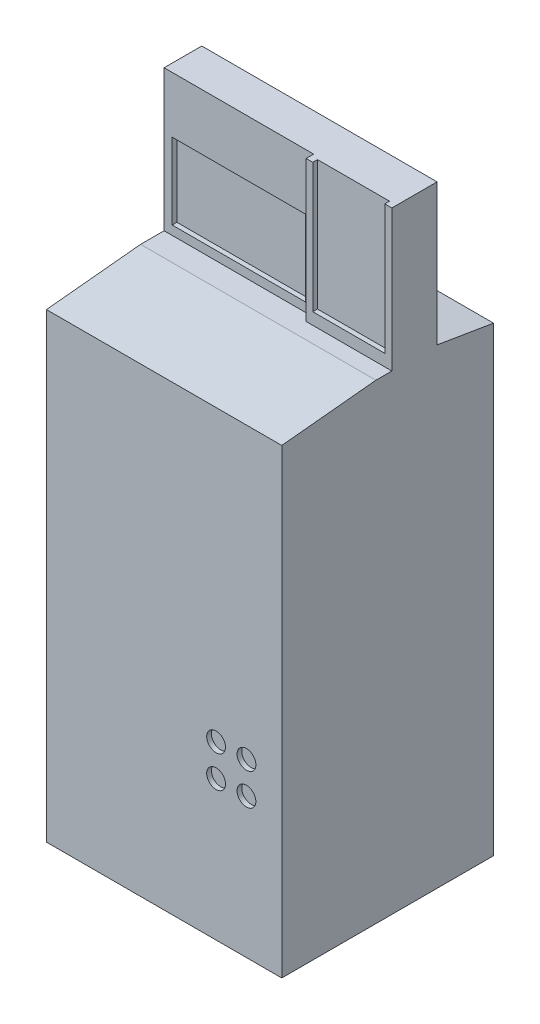
ISO-10303-21;
HEADER;
FILE_DESCRIPTION(('STEP AP214'),'2;1');
FILE_NAME('part.step','',(''),(''),'','','');
FILE_SCHEMA(('AUTOMOTIVE_DESIGN { 1 0 10303 214 1 1 1 1 }'));
ENDSEC;
DATA;
#1=APPLICATION_CONTEXT('core data for automotive mechanical design processes');
#2=APPLICATION_PROTOCOL_DEFINITION('international standard','automotive_design',2000,#1);
#3=PRODUCT_CONTEXT('',#1,'mechanical');
#4=PRODUCT('Part','Part','',(#3));
#5=PRODUCT_RELATED_PRODUCT_CATEGORY('part','',(#4));
#6=PRODUCT_DEFINITION_FORMATION('','',#4);
#7=PRODUCT_DEFINITION_CONTEXT('part definition',#1,'design');
#8=PRODUCT_DEFINITION('design','',#6,#7);
#9=PRODUCT_DEFINITION_SHAPE('','',#8);
#10=(LENGTH_UNIT() NAMED_UNIT(*) SI_UNIT(.MILLI.,.METRE.));
#11=(NAMED_UNIT(*) PLANE_ANGLE_UNIT() SI_UNIT($,.RADIAN.));
#12=(NAMED_UNIT(*) SI_UNIT($,.STERADIAN.) SOLID_ANGLE_UNIT());
#13=UNCERTAINTY_MEASURE_WITH_UNIT(LENGTH_MEASURE(1.E-05),#10,'distance_accuracy_value','');
#14=(GEOMETRIC_REPRESENTATION_CONTEXT(3) GLOBAL_UNCERTAINTY_ASSIGNED_CONTEXT((#13)) GLOBAL_UNIT_ASSIGNED_CONTEXT((#10,
#11,#12)) REPRESENTATION_CONTEXT('',''));
#15=CARTESIAN_POINT('',(0.,0.,0.));
#16=DIRECTION('',(0.,0.,1.));
#17=DIRECTION('',(1.,0.,0.));
#18=AXIS2_PLACEMENT_3D('',#15,#16,#17);
#19=CARTESIAN_POINT('',(0.,800.,0.));
#20=DIRECTION('',(0.,-1.,0.));
#21=DIRECTION('',(0.,0.,-1.));
#22=AXIS2_PLACEMENT_3D('',#19,#20,#21);
#23=PLANE('',#22);
#24=DIRECTION('',(1.,0.,0.));
#25=VECTOR('',#24,1.);
#26=CARTESIAN_POINT('',(0.,800.,-24.999984779868));
#27=LINE('',#26,#25);
#28=CARTESIAN_POINT('',(-250.,800.,-24.999984779868));
#29=VERTEX_POINT('',#28);
#30=CARTESIAN_POINT('',(67.8160506672203,800.,-24.999984779868));
#31=VERTEX_POINT('',#30);
#32=EDGE_CURVE('E309',#29,#31,#27,.T.);
#33=ORIENTED_EDGE('',*,*,#32,.F.);
#34=DIRECTION('',(0.,0.,1.));
#35=VECTOR('',#34,1.);
#36=CARTESIAN_POINT('',(-250.,800.,225.));
#37=LINE('',#36,#35);
#38=CARTESIAN_POINT('',(-250.,800.,24.999999999993));
#39=VERTEX_POINT('',#38);
#40=EDGE_CURVE('E359',#29,#39,#37,.T.);
#41=ORIENTED_EDGE('',*,*,#40,.T.);
#42=DIRECTION('',(1.,0.,0.));
#43=VECTOR('',#42,1.);
#44=CARTESIAN_POINT('',(250.,800.,24.999999999993));
#45=LINE('',#44,#43);
#46=CARTESIAN_POINT('',(250.,800.,24.999999999993));
#47=VERTEX_POINT('',#46);
#48=EDGE_CURVE('E377',#39,#47,#45,.T.);
#49=ORIENTED_EDGE('',*,*,#48,.T.);
#50=DIRECTION('',(0.,0.,-1.));
#51=VECTOR('',#50,1.);
#52=CARTESIAN_POINT('',(250.,800.,225.));
#53=LINE('',#52,#51);
#54=CARTESIAN_POINT('',(250.,800.,-8.90804055374794));
#55=VERTEX_POINT('',#54);
#56=EDGE_CURVE('E357',#47,#55,#53,.T.);
#57=ORIENTED_EDGE('',*,*,#56,.T.);
#58=DIRECTION('',(1.,0.,0.));
#59=VECTOR('',#58,1.);
#60=CARTESIAN_POINT('',(0.,800.,-8.90804055374795));
#61=LINE('',#60,#59);
#62=CARTESIAN_POINT('',(67.8160506672203,800.,-8.90804055374795));
#63=VERTEX_POINT('',#62);
#64=EDGE_CURVE('E320',#63,#55,#61,.T.);
#65=ORIENTED_EDGE('',*,*,#64,.F.);
#66=DIRECTION('',(0.,0.,1.));
#67=VECTOR('',#66,1.);
#68=CARTESIAN_POINT('',(67.8160506672203,800.,0.));
#69=LINE('',#68,#67);
#70=EDGE_CURVE('E335',#31,#63,#69,.T.);
#71=ORIENTED_EDGE('',*,*,#70,.F.);
#72=EDGE_LOOP('',(#33,#41,#49,#57,#65,#71));
#73=FACE_BOUND('',#72,.T.);
#74=ADVANCED_FACE('F41',(#73),#23,.F.);
#75=CARTESIAN_POINT('',(250.,-200.,225.));
#76=DIRECTION('',(1.,0.,0.));
#77=DIRECTION('',(0.,0.,-1.));
#78=AXIS2_PLACEMENT_3D('',#75,#76,#77);
#79=PLANE('',#78);
#80=DIRECTION('',(0.,1.,0.));
#81=VECTOR('',#80,1.);
#82=CARTESIAN_POINT('',(250.,-200.,-225.));
#83=LINE('',#82,#81);
#84=CARTESIAN_POINT('',(250.,-200.,-225.));
#85=VERTEX_POINT('',#84);
#86=CARTESIAN_POINT('',(250.,780.,-225.));
#87=VERTEX_POINT('',#86);
#88=EDGE_CURVE('E373',#85,#87,#83,.T.);
#89=ORIENTED_EDGE('',*,*,#88,.T.);
#90=DIRECTION('',(0.,0.164398987305354,0.986393923832144));
#91=VECTOR('',#90,1.);
#92=CARTESIAN_POINT('',(250.,826.486486486486,53.9189189189228));
#93=LINE('',#92,#91);
#94=CARTESIAN_POINT('',(250.,800.,-104.999999999997));
#95=VERTEX_POINT('',#94);
#96=EDGE_CURVE('E11',#87,#95,#93,.T.);
#97=ORIENTED_EDGE('',*,*,#96,.T.);
#98=DIRECTION('',(0.,-1.,0.));
#99=VECTOR('',#98,1.);
#100=CARTESIAN_POINT('',(250.,1100.,-104.999999999997));
#101=LINE('',#100,#99);
#102=CARTESIAN_POINT('',(250.,1100.,-104.999999999997));
#103=VERTEX_POINT('',#102);
#104=EDGE_CURVE('E345',#103,#95,#101,.T.);
#105=ORIENTED_EDGE('',*,*,#104,.F.);
#106=DIRECTION('',(0.,0.,-1.));
#107=VECTOR('',#106,1.);
#108=CARTESIAN_POINT('',(250.,1100.,0.));
#109=LINE('',#108,#107);
#110=CARTESIAN_POINT('',(250.,1100.,-8.90804055374795));
#111=VERTEX_POINT('',#110);
#112=EDGE_CURVE('E326',#111,#103,#109,.T.);
#113=ORIENTED_EDGE('',*,*,#112,.F.);
#114=DIRECTION('',(0.,-1.,0.));
#115=VECTOR('',#114,1.);
#116=CARTESIAN_POINT('',(250.,1100.,-8.90804055374795));
#117=LINE('',#116,#115);
#118=EDGE_CURVE('E348',#111,#55,#117,.T.);
#119=ORIENTED_EDGE('',*,*,#118,.T.);
#120=ORIENTED_EDGE('',*,*,#56,.F.);
#121=DIRECTION('',(0.,-0.0995037190209955,0.995037190209989));
#122=VECTOR('',#121,1.);
#123=CARTESIAN_POINT('',(250.,770.297029702971,322.029702970294));
#124=LINE('',#123,#122);
#125=CARTESIAN_POINT('',(250.,780.,225.));
#126=VERTEX_POINT('',#125);
#127=EDGE_CURVE('E388',#47,#126,#124,.T.);
#128=ORIENTED_EDGE('',*,*,#127,.T.);
#129=DIRECTION('',(0.,1.,0.));
#130=VECTOR('',#129,1.);
#131=CARTESIAN_POINT('',(250.,-200.,225.));
#132=LINE('',#131,#130);
#133=CARTESIAN_POINT('',(250.,-200.,225.));
#134=VERTEX_POINT('',#133);
#135=EDGE_CURVE('E374',#134,#126,#132,.T.);
#136=ORIENTED_EDGE('',*,*,#135,.F.);
#137=DIRECTION('',(0.,0.,-1.));
#138=VECTOR('',#137,1.);
#139=CARTESIAN_POINT('',(250.,-200.,225.));
#140=LINE('',#139,#138);
#141=EDGE_CURVE('E361',#134,#85,#140,.T.);
#142=ORIENTED_EDGE('',*,*,#141,.T.);
#143=EDGE_LOOP('',(#89,#97,#105,#113,#119,#120,#128,#136,#142));
#144=FACE_BOUND('',#143,.T.);
#145=ADVANCED_FACE('F406',(#144),#79,.T.);
#146=CARTESIAN_POINT('',(-250.,-200.,225.));
#147=DIRECTION('',(0.,0.,1.));
#148=DIRECTION('',(1.,0.,0.));
#149=AXIS2_PLACEMENT_3D('',#146,#147,#148);
#150=PLANE('',#149);
#151=CARTESIAN_POINT('',(174.96796499829,164.751161955834,225.));
#152=DIRECTION('',(0.,0.,1.));
#153=DIRECTION('',(1.,0.,0.));
#154=AXIS2_PLACEMENT_3D('',#151,#152,#153);
#155=CIRCLE('',#154,20.);
#156=CARTESIAN_POINT('',(194.96796499829,164.751161955834,225.));
#157=VERTEX_POINT('',#156);
#158=EDGE_CURVE('E272',#157,#157,#155,.T.);
#159=ORIENTED_EDGE('',*,*,#158,.F.);
#160=EDGE_LOOP('',(#159));
#161=FACE_BOUND('',#160,.T.);
#162=CARTESIAN_POINT('',(110.472474250745,97.0628251316776,225.));
#163=DIRECTION('',(0.,0.,1.));
#164=DIRECTION('',(1.,0.,0.));
#165=AXIS2_PLACEMENT_3D('',#162,#163,#164);
#166=CIRCLE('',#165,20.);
#167=CARTESIAN_POINT('',(130.472474250745,97.0628251316776,225.));
#168=VERTEX_POINT('',#167);
#169=EDGE_CURVE('E265',#168,#168,#166,.T.);
#170=ORIENTED_EDGE('',*,*,#169,.F.);
#171=EDGE_LOOP('',(#170));
#172=FACE_BOUND('',#171,.T.);
#173=CARTESIAN_POINT('',(174.96796499829,97.0628251316776,225.));
#174=DIRECTION('',(0.,0.,1.));
#175=DIRECTION('',(1.,0.,0.));
#176=AXIS2_PLACEMENT_3D('',#173,#174,#175);
#177=CIRCLE('',#176,20.);
#178=CARTESIAN_POINT('',(194.96796499829,97.0628251316776,225.));
#179=VERTEX_POINT('',#178);
#180=EDGE_CURVE('E255',#179,#179,#177,.T.);
#181=ORIENTED_EDGE('',*,*,#180,.F.);
#182=EDGE_LOOP('',(#181));
#183=FACE_BOUND('',#182,.T.);
#184=CARTESIAN_POINT('',(110.472474250745,164.751161955834,225.));
#185=DIRECTION('',(0.,0.,1.));
#186=DIRECTION('',(1.,0.,0.));
#187=AXIS2_PLACEMENT_3D('',#184,#185,#186);
#188=CIRCLE('',#187,20.);
#189=CARTESIAN_POINT('',(130.472474250745,164.751161955834,225.));
#190=VERTEX_POINT('',#189);
#191=EDGE_CURVE('E271',#190,#190,#188,.T.);
#192=ORIENTED_EDGE('',*,*,#191,.F.);
#193=EDGE_LOOP('',(#192));
#194=FACE_BOUND('',#193,.T.);
#195=ORIENTED_EDGE('',*,*,#135,.T.);
#196=DIRECTION('',(-1.,0.,0.));
#197=VECTOR('',#196,1.);
#198=CARTESIAN_POINT('',(-250.,780.,225.));
#199=LINE('',#198,#197);
#200=CARTESIAN_POINT('',(-250.,780.,225.));
#201=VERTEX_POINT('',#200);
#202=EDGE_CURVE('E390',#126,#201,#199,.T.);
#203=ORIENTED_EDGE('',*,*,#202,.T.);
#204=DIRECTION('',(0.,1.,0.));
#205=VECTOR('',#204,1.);
#206=CARTESIAN_POINT('',(-250.,-200.,225.));
#207=LINE('',#206,#205);
#208=CARTESIAN_POINT('',(-250.,-200.,225.));
#209=VERTEX_POINT('',#208);
#210=EDGE_CURVE('E378',#209,#201,#207,.T.);
#211=ORIENTED_EDGE('',*,*,#210,.F.);
#212=DIRECTION('',(1.,0.,0.));
#213=VECTOR('',#212,1.);
#214=CARTESIAN_POINT('',(-250.,-200.,225.));
#215=LINE('',#214,#213);
#216=EDGE_CURVE('E370',#209,#134,#215,.T.);
#217=ORIENTED_EDGE('',*,*,#216,.T.);
#218=EDGE_LOOP('',(#195,#203,#211,#217));
#219=FACE_BOUND('',#218,.T.);
#220=ADVANCED_FACE('F446',(#161,#172,#183,#194,#219),#150,.T.);
#221=CARTESIAN_POINT('',(-250.,-200.,225.));
#222=DIRECTION('',(-1.,0.,0.));
#223=DIRECTION('',(0.,0.,1.));
#224=AXIS2_PLACEMENT_3D('',#221,#222,#223);
#225=PLANE('',#224);
#226=ORIENTED_EDGE('',*,*,#40,.F.);
#227=DIRECTION('',(0.,-1.,0.));
#228=VECTOR('',#227,1.);
#229=CARTESIAN_POINT('',(-250.,1100.,-24.999984779868));
#230=LINE('',#229,#228);
#231=CARTESIAN_POINT('',(-250.,1100.,-24.999984779868));
#232=VERTEX_POINT('',#231);
#233=EDGE_CURVE('E332',#232,#29,#230,.T.);
#234=ORIENTED_EDGE('',*,*,#233,.F.);
#235=DIRECTION('',(0.,0.,1.));
#236=VECTOR('',#235,1.);
#237=CARTESIAN_POINT('',(-250.,1100.,0.));
#238=LINE('',#237,#236);
#239=CARTESIAN_POINT('',(-250.,1100.,-104.999999999997));
#240=VERTEX_POINT('',#239);
#241=EDGE_CURVE('E330',#240,#232,#238,.T.);
#242=ORIENTED_EDGE('',*,*,#241,.F.);
#243=DIRECTION('',(0.,-1.,0.));
#244=VECTOR('',#243,1.);
#245=CARTESIAN_POINT('',(-250.,1100.,-104.999999999997));
#246=LINE('',#245,#244);
#247=CARTESIAN_POINT('',(-250.,800.,-104.999999999997));
#248=VERTEX_POINT('',#247);
#249=EDGE_CURVE('E342',#240,#248,#246,.T.);
#250=ORIENTED_EDGE('',*,*,#249,.T.);
#251=DIRECTION('',(0.,-0.164398987305354,-0.986393923832144));
#252=VECTOR('',#251,1.);
#253=CARTESIAN_POINT('',(-250.,826.486486486486,53.9189189189228));
#254=LINE('',#253,#252);
#255=CARTESIAN_POINT('',(-250.,780.,-225.));
#256=VERTEX_POINT('',#255);
#257=EDGE_CURVE('E398',#248,#256,#254,.T.);
#258=ORIENTED_EDGE('',*,*,#257,.T.);
#259=DIRECTION('',(0.,1.,0.));
#260=VECTOR('',#259,1.);
#261=CARTESIAN_POINT('',(-250.,-200.,-225.));
#262=LINE('',#261,#260);
#263=CARTESIAN_POINT('',(-250.,-200.,-225.));
#264=VERTEX_POINT('',#263);
#265=EDGE_CURVE('E381',#264,#256,#262,.T.);
#266=ORIENTED_EDGE('',*,*,#265,.F.);
#267=DIRECTION('',(0.,0.,1.));
#268=VECTOR('',#267,1.);
#269=CARTESIAN_POINT('',(-250.,-200.,225.));
#270=LINE('',#269,#268);
#271=EDGE_CURVE('E367',#264,#209,#270,.T.);
#272=ORIENTED_EDGE('',*,*,#271,.T.);
#273=ORIENTED_EDGE('',*,*,#210,.T.);
#274=DIRECTION('',(0.,0.0995037190209955,-0.995037190209989));
#275=VECTOR('',#274,1.);
#276=CARTESIAN_POINT('',(-250.,770.297029702971,322.029702970294));
#277=LINE('',#276,#275);
#278=EDGE_CURVE('E392',#201,#39,#277,.T.);
#279=ORIENTED_EDGE('',*,*,#278,.T.);
#280=EDGE_LOOP('',(#226,#234,#242,#250,#258,#266,#272,#273,#279));
#281=FACE_BOUND('',#280,.T.);
#282=ADVANCED_FACE('F438',(#281),#225,.T.);
#283=CARTESIAN_POINT('',(-250.,-200.,-225.));
#284=DIRECTION('',(0.,0.,-1.));
#285=DIRECTION('',(-1.,0.,0.));
#286=AXIS2_PLACEMENT_3D('',#283,#284,#285);
#287=PLANE('',#286);
#288=DIRECTION('',(0.,-1.,0.));
#289=VECTOR('',#288,1.);
#290=CARTESIAN_POINT('',(201.098373674837,108.605665582961,-225.));
#291=LINE('',#290,#289);
#292=CARTESIAN_POINT('',(201.098373674837,108.605665582961,-225.));
#293=VERTEX_POINT('',#292);
#294=CARTESIAN_POINT('',(201.098373674837,-164.043042544086,-225.));
#295=VERTEX_POINT('',#294);
#296=EDGE_CURVE('E57',#293,#295,#291,.T.);
#297=ORIENTED_EDGE('',*,*,#296,.F.);
#298=DIRECTION('',(1.,0.,0.));
#299=VECTOR('',#298,1.);
#300=CARTESIAN_POINT('',(201.098373674837,108.605665582961,-225.));
#301=LINE('',#300,#299);
#302=CARTESIAN_POINT('',(-201.201468386829,108.605665582961,-225.));
#303=VERTEX_POINT('',#302);
#304=EDGE_CURVE('E218',#303,#293,#301,.T.);
#305=ORIENTED_EDGE('',*,*,#304,.F.);
#306=DIRECTION('',(0.,1.,0.));
#307=VECTOR('',#306,1.);
#308=CARTESIAN_POINT('',(-201.201468386829,108.605665582961,-225.));
#309=LINE('',#308,#307);
#310=CARTESIAN_POINT('',(-201.201468386829,-164.043042544086,-225.));
#311=VERTEX_POINT('',#310);
#312=EDGE_CURVE('E221',#311,#303,#309,.T.);
#313=ORIENTED_EDGE('',*,*,#312,.F.);
#314=DIRECTION('',(-1.,0.,0.));
#315=VECTOR('',#314,1.);
#316=CARTESIAN_POINT('',(201.098373674837,-164.043042544086,-225.));
#317=LINE('',#316,#315);
#318=EDGE_CURVE('E227',#295,#311,#317,.T.);
#319=ORIENTED_EDGE('',*,*,#318,.F.);
#320=EDGE_LOOP('',(#297,#305,#313,#319));
#321=FACE_BOUND('',#320,.T.);
#322=ORIENTED_EDGE('',*,*,#265,.T.);
#323=DIRECTION('',(1.,0.,0.));
#324=VECTOR('',#323,1.);
#325=CARTESIAN_POINT('',(250.,780.,-225.));
#326=LINE('',#325,#324);
#327=EDGE_CURVE('E50',#256,#87,#326,.T.);
#328=ORIENTED_EDGE('',*,*,#327,.T.);
#329=ORIENTED_EDGE('',*,*,#88,.F.);
#330=DIRECTION('',(-1.,0.,0.));
#331=VECTOR('',#330,1.);
#332=CARTESIAN_POINT('',(-250.,-200.,-225.));
#333=LINE('',#332,#331);
#334=EDGE_CURVE('E364',#85,#264,#333,.T.);
#335=ORIENTED_EDGE('',*,*,#334,.T.);
#336=EDGE_LOOP('',(#322,#328,#329,#335));
#337=FACE_BOUND('',#336,.T.);
#338=ADVANCED_FACE('F401',(#321,#337),#287,.T.);
#339=CARTESIAN_POINT('',(0.,-200.,0.));
#340=DIRECTION('',(0.,-1.,0.));
#341=DIRECTION('',(0.,0.,-1.));
#342=AXIS2_PLACEMENT_3D('',#339,#340,#341);
#343=PLANE('',#342);
#344=ORIENTED_EDGE('',*,*,#141,.F.);
#345=ORIENTED_EDGE('',*,*,#216,.F.);
#346=ORIENTED_EDGE('',*,*,#271,.F.);
#347=ORIENTED_EDGE('',*,*,#334,.F.);
#348=EDGE_LOOP('',(#344,#345,#346,#347));
#349=FACE_BOUND('',#348,.T.);
#350=ADVANCED_FACE('F450',(#349),#343,.T.);
#351=CARTESIAN_POINT('',(0.,800.,24.999999999993));
#352=DIRECTION('',(0.,0.995037190209989,0.0995037190209955));
#353=DIRECTION('',(-1.,0.,0.));
#354=AXIS2_PLACEMENT_3D('',#351,#352,#353);
#355=PLANE('',#354);
#356=ORIENTED_EDGE('',*,*,#278,.F.);
#357=ORIENTED_EDGE('',*,*,#202,.F.);
#358=ORIENTED_EDGE('',*,*,#127,.F.);
#359=ORIENTED_EDGE('',*,*,#48,.F.);
#360=EDGE_LOOP('',(#356,#357,#358,#359));
#361=FACE_BOUND('',#360,.T.);
#362=ADVANCED_FACE('F444',(#361),#355,.T.);
#363=CARTESIAN_POINT('',(0.,800.,-104.999999999997));
#364=DIRECTION('',(0.,0.986393923832144,-0.164398987305354));
#365=DIRECTION('',(1.,0.,0.));
#366=AXIS2_PLACEMENT_3D('',#363,#364,#365);
#367=PLANE('',#366);
#368=ORIENTED_EDGE('',*,*,#96,.F.);
#369=ORIENTED_EDGE('',*,*,#327,.F.);
#370=ORIENTED_EDGE('',*,*,#257,.F.);
#371=DIRECTION('',(-1.,0.,0.));
#372=VECTOR('',#371,1.);
#373=CARTESIAN_POINT('',(-250.,800.,-104.999999999997));
#374=LINE('',#373,#372);
#375=EDGE_CURVE('E395',#95,#248,#374,.T.);
#376=ORIENTED_EDGE('',*,*,#375,.F.);
#377=EDGE_LOOP('',(#368,#369,#370,#376));
#378=FACE_BOUND('',#377,.T.);
#379=ADVANCED_FACE('F44',(#378),#367,.T.);
#380=CARTESIAN_POINT('',(0.,1100.,-24.999984779868));
#381=DIRECTION('',(0.,0.,-1.));
#382=DIRECTION('',(-1.,0.,0.));
#383=AXIS2_PLACEMENT_3D('',#380,#381,#382);
#384=PLANE('',#383);
#385=DIRECTION('',(0.,1.,0.));
#386=VECTOR('',#385,1.);
#387=CARTESIAN_POINT('',(50.6339517604435,0.,-24.999984779868));
#388=LINE('',#387,#386);
#389=CARTESIAN_POINT('',(50.6339517604435,819.185653331347,-24.999984779868));
#390=VERTEX_POINT('',#389);
#391=CARTESIAN_POINT('',(50.6339517604435,980.814346668653,-24.999984779868));
#392=VERTEX_POINT('',#391);
#393=EDGE_CURVE('E299',#390,#392,#388,.T.);
#394=ORIENTED_EDGE('',*,*,#393,.F.);
#395=DIRECTION('',(1.,0.,0.));
#396=VECTOR('',#395,1.);
#397=CARTESIAN_POINT('',(0.,819.185653331347,-24.999984779868));
#398=LINE('',#397,#396);
#399=CARTESIAN_POINT('',(-232.817901093223,819.185653331347,-24.999984779868));
#400=VERTEX_POINT('',#399);
#401=EDGE_CURVE('E283',#400,#390,#398,.T.);
#402=ORIENTED_EDGE('',*,*,#401,.F.);
#403=DIRECTION('',(0.,1.,0.));
#404=VECTOR('',#403,1.);
#405=CARTESIAN_POINT('',(-232.817901093223,0.,-24.999984779868));
#406=LINE('',#405,#404);
#407=CARTESIAN_POINT('',(-232.817901093223,980.814346668653,-24.999984779868));
#408=VERTEX_POINT('',#407);
#409=EDGE_CURVE('E290',#400,#408,#406,.T.);
#410=ORIENTED_EDGE('',*,*,#409,.T.);
#411=DIRECTION('',(1.,0.,0.));
#412=VECTOR('',#411,1.);
#413=CARTESIAN_POINT('',(0.,980.814346668653,-24.999984779868));
#414=LINE('',#413,#412);
#415=EDGE_CURVE('E302',#408,#392,#414,.T.);
#416=ORIENTED_EDGE('',*,*,#415,.T.);
#417=EDGE_LOOP('',(#394,#402,#410,#416));
#418=FACE_BOUND('',#417,.T.);
#419=ORIENTED_EDGE('',*,*,#32,.T.);
#420=DIRECTION('',(0.,-1.,0.));
#421=VECTOR('',#420,1.);
#422=CARTESIAN_POINT('',(67.8160506672203,1100.,-24.999984779868));
#423=LINE('',#422,#421);
#424=CARTESIAN_POINT('',(67.8160506672203,1100.,-24.999984779868));
#425=VERTEX_POINT('',#424);
#426=EDGE_CURVE('E354',#425,#31,#423,.T.);
#427=ORIENTED_EDGE('',*,*,#426,.F.);
#428=DIRECTION('',(1.,0.,0.));
#429=VECTOR('',#428,1.);
#430=CARTESIAN_POINT('',(0.,1100.,-24.999984779868));
#431=LINE('',#430,#429);
#432=EDGE_CURVE('E316',#232,#425,#431,.T.);
#433=ORIENTED_EDGE('',*,*,#432,.F.);
#434=ORIENTED_EDGE('',*,*,#233,.T.);
#435=EDGE_LOOP('',(#419,#427,#433,#434));
#436=FACE_BOUND('',#435,.T.);
#437=ADVANCED_FACE('F434',(#418,#436),#384,.F.);
#438=CARTESIAN_POINT('',(67.8160506672203,1100.,0.));
#439=DIRECTION('',(1.,0.,0.));
#440=DIRECTION('',(0.,0.,-1.));
#441=AXIS2_PLACEMENT_3D('',#438,#439,#440);
#442=PLANE('',#441);
#443=ORIENTED_EDGE('',*,*,#70,.T.);
#444=DIRECTION('',(0.,-1.,0.));
#445=VECTOR('',#444,1.);
#446=CARTESIAN_POINT('',(67.8160506672203,1100.,-8.90804055374795));
#447=LINE('',#446,#445);
#448=CARTESIAN_POINT('',(67.8160506672203,1100.,-8.90804055374795));
#449=VERTEX_POINT('',#448);
#450=EDGE_CURVE('E351',#449,#63,#447,.T.);
#451=ORIENTED_EDGE('',*,*,#450,.F.);
#452=DIRECTION('',(0.,0.,1.));
#453=VECTOR('',#452,1.);
#454=CARTESIAN_POINT('',(67.8160506672203,1100.,0.));
#455=LINE('',#454,#453);
#456=EDGE_CURVE('E319',#425,#449,#455,.T.);
#457=ORIENTED_EDGE('',*,*,#456,.F.);
#458=ORIENTED_EDGE('',*,*,#426,.T.);
#459=EDGE_LOOP('',(#443,#451,#457,#458));
#460=FACE_BOUND('',#459,.T.);
#461=ADVANCED_FACE('F430',(#460),#442,.F.);
#462=CARTESIAN_POINT('',(0.,1100.,-8.90804055374795));
#463=DIRECTION('',(0.,0.,-1.));
#464=DIRECTION('',(-1.,0.,0.));
#465=AXIS2_PLACEMENT_3D('',#462,#463,#464);
#466=PLANE('',#465);
#467=DIRECTION('',(1.,0.,0.));
#468=VECTOR('',#467,1.);
#469=CARTESIAN_POINT('',(81.9672277723067,825.045113674106,-8.90804055374795));
#470=LINE('',#469,#468);
#471=CARTESIAN_POINT('',(81.9672277723067,825.045113674106,-8.90804055374795));
#472=VERTEX_POINT('',#471);
#473=CARTESIAN_POINT('',(234.964906360065,825.045113674106,-8.90804055374795));
#474=VERTEX_POINT('',#473);
#475=EDGE_CURVE('E249',#472,#474,#470,.T.);
#476=ORIENTED_EDGE('',*,*,#475,.F.);
#477=DIRECTION('',(0.,-1.,0.));
#478=VECTOR('',#477,1.);
#479=CARTESIAN_POINT('',(81.9672277723067,1100.,-8.90804055374795));
#480=LINE('',#479,#478);
#481=CARTESIAN_POINT('',(81.9672277723067,1100.,-8.90804055374795));
#482=VERTEX_POINT('',#481);
#483=EDGE_CURVE('E233',#482,#472,#480,.T.);
#484=ORIENTED_EDGE('',*,*,#483,.F.);
#485=DIRECTION('',(1.,0.,0.));
#486=VECTOR('',#485,1.);
#487=CARTESIAN_POINT('',(0.,1100.,-8.90804055374795));
#488=LINE('',#487,#486);
#489=EDGE_CURVE('E323',#449,#482,#488,.T.);
#490=ORIENTED_EDGE('',*,*,#489,.F.);
#491=ORIENTED_EDGE('',*,*,#450,.T.);
#492=ORIENTED_EDGE('',*,*,#64,.T.);
#493=ORIENTED_EDGE('',*,*,#118,.F.);
#494=CARTESIAN_POINT('',(234.964906360065,1100.,-8.90804055374795));
#495=VERTEX_POINT('',#494);
#496=EDGE_CURVE('E322',#495,#111,#488,.T.);
#497=ORIENTED_EDGE('',*,*,#496,.F.);
#498=DIRECTION('',(0.,1.,0.));
#499=VECTOR('',#498,1.);
#500=CARTESIAN_POINT('',(234.964906360065,1100.,-8.90804055374795));
#501=LINE('',#500,#499);
#502=EDGE_CURVE('E241',#474,#495,#501,.T.);
#503=ORIENTED_EDGE('',*,*,#502,.F.);
#504=EDGE_LOOP('',(#476,#484,#490,#491,#492,#493,#497,#503));
#505=FACE_BOUND('',#504,.T.);
#506=ADVANCED_FACE('F425',(#505),#466,.F.);
#507=CARTESIAN_POINT('',(0.,1100.,-104.999999999997));
#508=DIRECTION('',(0.,0.,1.));
#509=DIRECTION('',(1.,0.,0.));
#510=AXIS2_PLACEMENT_3D('',#507,#508,#509);
#511=PLANE('',#510);
#512=ORIENTED_EDGE('',*,*,#375,.T.);
#513=ORIENTED_EDGE('',*,*,#249,.F.);
#514=DIRECTION('',(-1.,0.,0.));
#515=VECTOR('',#514,1.);
#516=CARTESIAN_POINT('',(0.,1100.,-104.999999999997));
#517=LINE('',#516,#515);
#518=EDGE_CURVE('E328',#103,#240,#517,.T.);
#519=ORIENTED_EDGE('',*,*,#518,.F.);
#520=ORIENTED_EDGE('',*,*,#104,.T.);
#521=EDGE_LOOP('',(#512,#513,#519,#520));
#522=FACE_BOUND('',#521,.T.);
#523=ADVANCED_FACE('F413',(#522),#511,.F.);
#524=CARTESIAN_POINT('',(0.,1100.,0.));
#525=DIRECTION('',(0.,1.,0.));
#526=DIRECTION('',(0.,0.,1.));
#527=AXIS2_PLACEMENT_3D('',#524,#525,#526);
#528=PLANE('',#527);
#529=DIRECTION('',(0.,0.,1.));
#530=VECTOR('',#529,1.);
#531=CARTESIAN_POINT('',(81.9672277723067,1100.,-18.908040553748));
#532=LINE('',#531,#530);
#533=CARTESIAN_POINT('',(81.9672277723067,1100.,-18.908040553748));
#534=VERTEX_POINT('',#533);
#535=EDGE_CURVE('E253',#534,#482,#532,.T.);
#536=ORIENTED_EDGE('',*,*,#535,.F.);
#537=DIRECTION('',(-1.,0.,0.));
#538=VECTOR('',#537,1.);
#539=CARTESIAN_POINT('',(81.9672277723067,1100.,-18.908040553748));
#540=LINE('',#539,#538);
#541=CARTESIAN_POINT('',(234.964906360065,1100.,-18.908040553748));
#542=VERTEX_POINT('',#541);
#543=EDGE_CURVE('E244',#542,#534,#540,.T.);
#544=ORIENTED_EDGE('',*,*,#543,.F.);
#545=DIRECTION('',(0.,0.,1.));
#546=VECTOR('',#545,1.);
#547=CARTESIAN_POINT('',(234.964906360065,1100.,-18.908040553748));
#548=LINE('',#547,#546);
#549=EDGE_CURVE('E256',#542,#495,#548,.T.);
#550=ORIENTED_EDGE('',*,*,#549,.T.);
#551=ORIENTED_EDGE('',*,*,#496,.T.);
#552=ORIENTED_EDGE('',*,*,#112,.T.);
#553=ORIENTED_EDGE('',*,*,#518,.T.);
#554=ORIENTED_EDGE('',*,*,#241,.T.);
#555=ORIENTED_EDGE('',*,*,#432,.T.);
#556=ORIENTED_EDGE('',*,*,#456,.T.);
#557=ORIENTED_EDGE('',*,*,#489,.T.);
#558=EDGE_LOOP('',(#536,#544,#550,#551,#552,#553,#554,#555,#556,#557));
#559=FACE_BOUND('',#558,.T.);
#560=ADVANCED_FACE('F419',(#559),#528,.T.);
#561=CARTESIAN_POINT('',(0.,819.185653331347,-34.999984779868));
#562=DIRECTION('',(0.,-1.,0.));
#563=DIRECTION('',(0.,0.,-1.));
#564=AXIS2_PLACEMENT_3D('',#561,#562,#563);
#565=PLANE('',#564);
#566=ORIENTED_EDGE('',*,*,#401,.T.);
#567=DIRECTION('',(0.,0.,1.));
#568=VECTOR('',#567,1.);
#569=CARTESIAN_POINT('',(50.6339517604435,819.185653331347,-34.999984779868));
#570=LINE('',#569,#568);
#571=CARTESIAN_POINT('',(50.6339517604435,819.185653331347,-34.999984779868));
#572=VERTEX_POINT('',#571);
#573=EDGE_CURVE('E297',#572,#390,#570,.T.);
#574=ORIENTED_EDGE('',*,*,#573,.F.);
#575=DIRECTION('',(1.,0.,0.));
#576=VECTOR('',#575,1.);
#577=CARTESIAN_POINT('',(0.,819.185653331347,-34.999984779868));
#578=LINE('',#577,#576);
#579=CARTESIAN_POINT('',(-232.817901093223,819.185653331347,-34.999984779868));
#580=VERTEX_POINT('',#579);
#581=EDGE_CURVE('E286',#580,#572,#578,.T.);
#582=ORIENTED_EDGE('',*,*,#581,.F.);
#583=DIRECTION('',(0.,0.,1.));
#584=VECTOR('',#583,1.);
#585=CARTESIAN_POINT('',(-232.817901093223,819.185653331347,-34.999984779868));
#586=LINE('',#585,#584);
#587=EDGE_CURVE('E307',#580,#400,#586,.T.);
#588=ORIENTED_EDGE('',*,*,#587,.T.);
#589=EDGE_LOOP('',(#566,#574,#582,#588));
#590=FACE_BOUND('',#589,.T.);
#591=ADVANCED_FACE('F510',(#590),#565,.F.);
#592=CARTESIAN_POINT('',(-232.817901093223,0.,-34.999984779868));
#593=DIRECTION('',(1.,0.,0.));
#594=DIRECTION('',(0.,0.,-1.));
#595=AXIS2_PLACEMENT_3D('',#592,#593,#594);
#596=PLANE('',#595);
#597=ORIENTED_EDGE('',*,*,#409,.F.);
#598=ORIENTED_EDGE('',*,*,#587,.F.);
#599=DIRECTION('',(0.,1.,0.));
#600=VECTOR('',#599,1.);
#601=CARTESIAN_POINT('',(-232.817901093223,0.,-34.999984779868));
#602=LINE('',#601,#600);
#603=CARTESIAN_POINT('',(-232.817901093223,980.814346668653,-34.999984779868));
#604=VERTEX_POINT('',#603);
#605=EDGE_CURVE('E295',#580,#604,#602,.T.);
#606=ORIENTED_EDGE('',*,*,#605,.T.);
#607=DIRECTION('',(0.,0.,1.));
#608=VECTOR('',#607,1.);
#609=CARTESIAN_POINT('',(-232.817901093223,980.814346668653,-34.999984779868));
#610=LINE('',#609,#608);
#611=EDGE_CURVE('E310',#604,#408,#610,.T.);
#612=ORIENTED_EDGE('',*,*,#611,.T.);
#613=EDGE_LOOP('',(#597,#598,#606,#612));
#614=FACE_BOUND('',#613,.T.);
#615=ADVANCED_FACE('F514',(#614),#596,.T.);
#616=CARTESIAN_POINT('',(0.,980.814346668653,-34.999984779868));
#617=DIRECTION('',(0.,-1.,0.));
#618=DIRECTION('',(0.,0.,-1.));
#619=AXIS2_PLACEMENT_3D('',#616,#617,#618);
#620=PLANE('',#619);
#621=ORIENTED_EDGE('',*,*,#415,.F.);
#622=ORIENTED_EDGE('',*,*,#611,.F.);
#623=DIRECTION('',(1.,0.,0.));
#624=VECTOR('',#623,1.);
#625=CARTESIAN_POINT('',(0.,980.814346668653,-34.999984779868));
#626=LINE('',#625,#624);
#627=CARTESIAN_POINT('',(50.6339517604435,980.814346668653,-34.999984779868));
#628=VERTEX_POINT('',#627);
#629=EDGE_CURVE('E293',#604,#628,#626,.T.);
#630=ORIENTED_EDGE('',*,*,#629,.T.);
#631=DIRECTION('',(0.,0.,1.));
#632=VECTOR('',#631,1.);
#633=CARTESIAN_POINT('',(50.6339517604435,980.814346668653,-34.999984779868));
#634=LINE('',#633,#632);
#635=EDGE_CURVE('E312',#628,#392,#634,.T.);
#636=ORIENTED_EDGE('',*,*,#635,.T.);
#637=EDGE_LOOP('',(#621,#622,#630,#636));
#638=FACE_BOUND('',#637,.T.);
#639=ADVANCED_FACE('F518',(#638),#620,.T.);
#640=CARTESIAN_POINT('',(50.6339517604435,0.,-34.999984779868));
#641=DIRECTION('',(1.,0.,0.));
#642=DIRECTION('',(0.,0.,-1.));
#643=AXIS2_PLACEMENT_3D('',#640,#641,#642);
#644=PLANE('',#643);
#645=ORIENTED_EDGE('',*,*,#393,.T.);
#646=ORIENTED_EDGE('',*,*,#635,.F.);
#647=DIRECTION('',(0.,1.,0.));
#648=VECTOR('',#647,1.);
#649=CARTESIAN_POINT('',(50.6339517604435,0.,-34.999984779868));
#650=LINE('',#649,#648);
#651=EDGE_CURVE('E289',#572,#628,#650,.T.);
#652=ORIENTED_EDGE('',*,*,#651,.F.);
#653=ORIENTED_EDGE('',*,*,#573,.T.);
#654=EDGE_LOOP('',(#645,#646,#652,#653));
#655=FACE_BOUND('',#654,.T.);
#656=ADVANCED_FACE('F506',(#655),#644,.F.);
#657=CARTESIAN_POINT('',(0.,0.,-34.999984779868));
#658=DIRECTION('',(0.,0.,1.));
#659=DIRECTION('',(1.,0.,0.));
#660=AXIS2_PLACEMENT_3D('',#657,#658,#659);
#661=PLANE('',#660);
#662=ORIENTED_EDGE('',*,*,#581,.T.);
#663=ORIENTED_EDGE('',*,*,#651,.T.);
#664=ORIENTED_EDGE('',*,*,#629,.F.);
#665=ORIENTED_EDGE('',*,*,#605,.F.);
#666=EDGE_LOOP('',(#662,#663,#664,#665));
#667=FACE_BOUND('',#666,.T.);
#668=ADVANCED_FACE('F520',(#667),#661,.T.);
#669=CARTESIAN_POINT('',(110.472474250745,164.751161955834,215.));
#670=DIRECTION('',(0.,0.,1.));
#671=DIRECTION('',(1.,0.,0.));
#672=AXIS2_PLACEMENT_3D('',#669,#670,#671);
#673=CYLINDRICAL_SURFACE('',#672,20.);
#674=CARTESIAN_POINT('',(110.472474250745,164.751161955834,215.));
#675=DIRECTION('',(0.,0.,1.));
#676=DIRECTION('',(1.,0.,0.));
#677=AXIS2_PLACEMENT_3D('',#674,#675,#676);
#678=CIRCLE('',#677,20.);
#679=CARTESIAN_POINT('',(130.472474250745,164.751161955834,215.));
#680=VERTEX_POINT('',#679);
#681=EDGE_CURVE('E280',#680,#680,#678,.T.);
#682=ORIENTED_EDGE('',*,*,#681,.F.);
#683=EDGE_LOOP('',(#682));
#684=FACE_BOUND('',#683,.T.);
#685=ORIENTED_EDGE('',*,*,#191,.T.);
#686=EDGE_LOOP('',(#685));
#687=FACE_BOUND('',#686,.T.);
#688=ADVANCED_FACE('F522',(#684,#687),#673,.F.);
#689=CARTESIAN_POINT('',(0.,0.,215.));
#690=DIRECTION('',(0.,0.,1.));
#691=DIRECTION('',(1.,0.,0.));
#692=AXIS2_PLACEMENT_3D('',#689,#690,#691);
#693=PLANE('',#692);
#694=ORIENTED_EDGE('',*,*,#681,.T.);
#695=EDGE_LOOP('',(#694));
#696=FACE_BOUND('',#695,.T.);
#697=ADVANCED_FACE('F528',(#696),#693,.T.);
#698=CARTESIAN_POINT('',(174.96796499829,97.0628251316776,215.));
#699=DIRECTION('',(0.,0.,1.));
#700=DIRECTION('',(1.,0.,0.));
#701=AXIS2_PLACEMENT_3D('',#698,#699,#700);
#702=CYLINDRICAL_SURFACE('',#701,20.);
#703=CARTESIAN_POINT('',(174.96796499829,97.0628251316776,215.));
#704=DIRECTION('',(0.,0.,1.));
#705=DIRECTION('',(1.,0.,0.));
#706=AXIS2_PLACEMENT_3D('',#703,#704,#705);
#707=CIRCLE('',#706,20.);
#708=CARTESIAN_POINT('',(194.96796499829,97.0628251316776,215.));
#709=VERTEX_POINT('',#708);
#710=EDGE_CURVE('E262',#709,#709,#707,.T.);
#711=ORIENTED_EDGE('',*,*,#710,.F.);
#712=EDGE_LOOP('',(#711));
#713=FACE_BOUND('',#712,.T.);
#714=ORIENTED_EDGE('',*,*,#180,.T.);
#715=EDGE_LOOP('',(#714));
#716=FACE_BOUND('',#715,.T.);
#717=ADVANCED_FACE('F606',(#713,#716),#702,.F.);
#718=CARTESIAN_POINT('',(0.,0.,215.));
#719=DIRECTION('',(0.,0.,1.));
#720=DIRECTION('',(1.,0.,0.));
#721=AXIS2_PLACEMENT_3D('',#718,#719,#720);
#722=PLANE('',#721);
#723=ORIENTED_EDGE('',*,*,#710,.T.);
#724=EDGE_LOOP('',(#723));
#725=FACE_BOUND('',#724,.T.);
#726=ADVANCED_FACE('F615',(#725),#722,.T.);
#727=CARTESIAN_POINT('',(110.472474250745,97.0628251316776,215.));
#728=DIRECTION('',(0.,0.,1.));
#729=DIRECTION('',(1.,0.,0.));
#730=AXIS2_PLACEMENT_3D('',#727,#728,#729);
#731=CYLINDRICAL_SURFACE('',#730,20.);
#732=CARTESIAN_POINT('',(110.472474250745,97.0628251316776,215.));
#733=DIRECTION('',(0.,0.,1.));
#734=DIRECTION('',(1.,0.,0.));
#735=AXIS2_PLACEMENT_3D('',#732,#733,#734);
#736=CIRCLE('',#735,20.);
#737=CARTESIAN_POINT('',(130.472474250745,97.0628251316776,215.));
#738=VERTEX_POINT('',#737);
#739=EDGE_CURVE('E275',#738,#738,#736,.T.);
#740=ORIENTED_EDGE('',*,*,#739,.F.);
#741=EDGE_LOOP('',(#740));
#742=FACE_BOUND('',#741,.T.);
#743=ORIENTED_EDGE('',*,*,#169,.T.);
#744=EDGE_LOOP('',(#743));
#745=FACE_BOUND('',#744,.T.);
#746=ADVANCED_FACE('F625',(#742,#745),#731,.F.);
#747=CARTESIAN_POINT('',(0.,0.,215.));
#748=DIRECTION('',(0.,0.,1.));
#749=DIRECTION('',(1.,0.,0.));
#750=AXIS2_PLACEMENT_3D('',#747,#748,#749);
#751=PLANE('',#750);
#752=ORIENTED_EDGE('',*,*,#739,.T.);
#753=EDGE_LOOP('',(#752));
#754=FACE_BOUND('',#753,.T.);
#755=ADVANCED_FACE('F635',(#754),#751,.T.);
#756=CARTESIAN_POINT('',(174.96796499829,164.751161955834,215.));
#757=DIRECTION('',(0.,0.,1.));
#758=DIRECTION('',(1.,0.,0.));
#759=AXIS2_PLACEMENT_3D('',#756,#757,#758);
#760=CYLINDRICAL_SURFACE('',#759,20.);
#761=CARTESIAN_POINT('',(174.96796499829,164.751161955834,215.));
#762=DIRECTION('',(0.,0.,1.));
#763=DIRECTION('',(1.,0.,0.));
#764=AXIS2_PLACEMENT_3D('',#761,#762,#763);
#765=CIRCLE('',#764,20.);
#766=CARTESIAN_POINT('',(194.96796499829,164.751161955834,215.));
#767=VERTEX_POINT('',#766);
#768=EDGE_CURVE('E268',#767,#767,#765,.T.);
#769=ORIENTED_EDGE('',*,*,#768,.F.);
#770=EDGE_LOOP('',(#769));
#771=FACE_BOUND('',#770,.T.);
#772=ORIENTED_EDGE('',*,*,#158,.T.);
#773=EDGE_LOOP('',(#772));
#774=FACE_BOUND('',#773,.T.);
#775=ADVANCED_FACE('F645',(#771,#774),#760,.F.);
#776=CARTESIAN_POINT('',(0.,0.,215.));
#777=DIRECTION('',(0.,0.,1.));
#778=DIRECTION('',(1.,0.,0.));
#779=AXIS2_PLACEMENT_3D('',#776,#777,#778);
#780=PLANE('',#779);
#781=ORIENTED_EDGE('',*,*,#768,.T.);
#782=EDGE_LOOP('',(#781));
#783=FACE_BOUND('',#782,.T.);
#784=ADVANCED_FACE('F654',(#783),#780,.T.);
#785=CARTESIAN_POINT('',(81.9672277723067,1100.,-18.908040553748));
#786=DIRECTION('',(-1.,0.,0.));
#787=DIRECTION('',(0.,0.,1.));
#788=AXIS2_PLACEMENT_3D('',#785,#786,#787);
#789=PLANE('',#788);
#790=ORIENTED_EDGE('',*,*,#483,.T.);
#791=DIRECTION('',(0.,0.,1.));
#792=VECTOR('',#791,1.);
#793=CARTESIAN_POINT('',(81.9672277723067,825.045113674106,-18.908040553748));
#794=LINE('',#793,#792);
#795=CARTESIAN_POINT('',(81.9672277723067,825.045113674106,-18.908040553748));
#796=VERTEX_POINT('',#795);
#797=EDGE_CURVE('E246',#796,#472,#794,.T.);
#798=ORIENTED_EDGE('',*,*,#797,.F.);
#799=DIRECTION('',(0.,-1.,0.));
#800=VECTOR('',#799,1.);
#801=CARTESIAN_POINT('',(81.9672277723067,1100.,-18.908040553748));
#802=LINE('',#801,#800);
#803=EDGE_CURVE('E237',#534,#796,#802,.T.);
#804=ORIENTED_EDGE('',*,*,#803,.F.);
#805=ORIENTED_EDGE('',*,*,#535,.T.);
#806=EDGE_LOOP('',(#790,#798,#804,#805));
#807=FACE_BOUND('',#806,.T.);
#808=ADVANCED_FACE('F453',(#807),#789,.F.);
#809=CARTESIAN_POINT('',(234.964906360065,1100.,-18.908040553748));
#810=DIRECTION('',(1.,0.,0.));
#811=DIRECTION('',(0.,0.,-1.));
#812=AXIS2_PLACEMENT_3D('',#809,#810,#811);
#813=PLANE('',#812);
#814=ORIENTED_EDGE('',*,*,#502,.T.);
#815=ORIENTED_EDGE('',*,*,#549,.F.);
#816=DIRECTION('',(0.,1.,0.));
#817=VECTOR('',#816,1.);
#818=CARTESIAN_POINT('',(234.964906360065,1100.,-18.908040553748));
#819=LINE('',#818,#817);
#820=CARTESIAN_POINT('',(234.964906360065,825.045113674106,-18.908040553748));
#821=VERTEX_POINT('',#820);
#822=EDGE_CURVE('E65',#821,#542,#819,.T.);
#823=ORIENTED_EDGE('',*,*,#822,.F.);
#824=DIRECTION('',(0.,0.,1.));
#825=VECTOR('',#824,1.);
#826=CARTESIAN_POINT('',(234.964906360065,825.045113674106,-18.908040553748));
#827=LINE('',#826,#825);
#828=EDGE_CURVE('E259',#821,#474,#827,.T.);
#829=ORIENTED_EDGE('',*,*,#828,.T.);
#830=EDGE_LOOP('',(#814,#815,#823,#829));
#831=FACE_BOUND('',#830,.T.);
#832=ADVANCED_FACE('F465',(#831),#813,.F.);
#833=CARTESIAN_POINT('',(81.9672277723067,825.045113674106,-18.908040553748));
#834=DIRECTION('',(0.,-1.,0.));
#835=DIRECTION('',(0.,0.,-1.));
#836=AXIS2_PLACEMENT_3D('',#833,#834,#835);
#837=PLANE('',#836);
#838=ORIENTED_EDGE('',*,*,#475,.T.);
#839=ORIENTED_EDGE('',*,*,#828,.F.);
#840=DIRECTION('',(1.,0.,0.));
#841=VECTOR('',#840,1.);
#842=CARTESIAN_POINT('',(81.9672277723067,825.045113674106,-18.908040553748));
#843=LINE('',#842,#841);
#844=EDGE_CURVE('E240',#796,#821,#843,.T.);
#845=ORIENTED_EDGE('',*,*,#844,.F.);
#846=ORIENTED_EDGE('',*,*,#797,.T.);
#847=EDGE_LOOP('',(#838,#839,#845,#846));
#848=FACE_BOUND('',#847,.T.);
#849=ADVANCED_FACE('F457',(#848),#837,.F.);
#850=CARTESIAN_POINT('',(0.,0.,-18.908040553748));
#851=DIRECTION('',(0.,0.,1.));
#852=DIRECTION('',(1.,0.,0.));
#853=AXIS2_PLACEMENT_3D('',#850,#851,#852);
#854=PLANE('',#853);
#855=ORIENTED_EDGE('',*,*,#803,.T.);
#856=ORIENTED_EDGE('',*,*,#844,.T.);
#857=ORIENTED_EDGE('',*,*,#822,.T.);
#858=ORIENTED_EDGE('',*,*,#543,.T.);
#859=EDGE_LOOP('',(#855,#856,#857,#858));
#860=FACE_BOUND('',#859,.T.);
#861=ADVANCED_FACE('F455',(#860),#854,.T.);
#862=CARTESIAN_POINT('',(201.098373674837,108.605665582961,-155.));
#863=DIRECTION('',(1.,0.,0.));
#864=DIRECTION('',(0.,0.,-1.));
#865=AXIS2_PLACEMENT_3D('',#862,#863,#864);
#866=PLANE('',#865);
#867=ORIENTED_EDGE('',*,*,#296,.T.);
#868=DIRECTION('',(0.,0.,-1.));
#869=VECTOR('',#868,1.);
#870=CARTESIAN_POINT('',(201.098373674837,-164.043042544086,-155.));
#871=LINE('',#870,#869);
#872=CARTESIAN_POINT('',(201.098373674837,-164.043042544086,-155.));
#873=VERTEX_POINT('',#872);
#874=EDGE_CURVE('E196',#873,#295,#871,.T.);
#875=ORIENTED_EDGE('',*,*,#874,.F.);
#876=DIRECTION('',(0.,-1.,0.));
#877=VECTOR('',#876,1.);
#878=CARTESIAN_POINT('',(201.098373674837,108.605665582961,-155.));
#879=LINE('',#878,#877);
#880=CARTESIAN_POINT('',(201.098373674837,108.605665582961,-155.));
#881=VERTEX_POINT('',#880);
#882=EDGE_CURVE('E200',#881,#873,#879,.T.);
#883=ORIENTED_EDGE('',*,*,#882,.F.);
#884=DIRECTION('',(0.,0.,-1.));
#885=VECTOR('',#884,1.);
#886=CARTESIAN_POINT('',(201.098373674837,108.605665582961,-155.));
#887=LINE('',#886,#885);
#888=EDGE_CURVE('E231',#881,#293,#887,.T.);
#889=ORIENTED_EDGE('',*,*,#888,.T.);
#890=EDGE_LOOP('',(#867,#875,#883,#889));
#891=FACE_BOUND('',#890,.T.);
#892=ADVANCED_FACE('F198',(#891),#866,.F.);
#893=CARTESIAN_POINT('',(201.098373674837,108.605665582961,-155.));
#894=DIRECTION('',(0.,1.,0.));
#895=DIRECTION('',(0.,0.,1.));
#896=AXIS2_PLACEMENT_3D('',#893,#894,#895);
#897=PLANE('',#896);
#898=ORIENTED_EDGE('',*,*,#304,.T.);
#899=ORIENTED_EDGE('',*,*,#888,.F.);
#900=DIRECTION('',(1.,0.,0.));
#901=VECTOR('',#900,1.);
#902=CARTESIAN_POINT('',(201.098373674837,108.605665582961,-155.));
#903=LINE('',#902,#901);
#904=CARTESIAN_POINT('',(-201.201468386829,108.605665582961,-155.));
#905=VERTEX_POINT('',#904);
#906=EDGE_CURVE('E206',#905,#881,#903,.T.);
#907=ORIENTED_EDGE('',*,*,#906,.F.);
#908=DIRECTION('',(0.,0.,-1.));
#909=VECTOR('',#908,1.);
#910=CARTESIAN_POINT('',(-201.201468386829,108.605665582961,-155.));
#911=LINE('',#910,#909);
#912=EDGE_CURVE('E234',#905,#303,#911,.T.);
#913=ORIENTED_EDGE('',*,*,#912,.T.);
#914=EDGE_LOOP('',(#898,#899,#907,#913));
#915=FACE_BOUND('',#914,.T.);
#916=ADVANCED_FACE('F463',(#915),#897,.F.);
#917=CARTESIAN_POINT('',(-201.201468386829,108.605665582961,-155.));
#918=DIRECTION('',(-1.,0.,0.));
#919=DIRECTION('',(0.,0.,1.));
#920=AXIS2_PLACEMENT_3D('',#917,#918,#919);
#921=PLANE('',#920);
#922=ORIENTED_EDGE('',*,*,#312,.T.);
#923=ORIENTED_EDGE('',*,*,#912,.F.);
#924=DIRECTION('',(0.,1.,0.));
#925=VECTOR('',#924,1.);
#926=CARTESIAN_POINT('',(-201.201468386829,108.605665582961,-155.));
#927=LINE('',#926,#925);
#928=CARTESIAN_POINT('',(-201.201468386829,-164.043042544086,-155.));
#929=VERTEX_POINT('',#928);
#930=EDGE_CURVE('E214',#929,#905,#927,.T.);
#931=ORIENTED_EDGE('',*,*,#930,.F.);
#932=DIRECTION('',(0.,0.,-1.));
#933=VECTOR('',#932,1.);
#934=CARTESIAN_POINT('',(-201.201468386829,-164.043042544086,-155.));
#935=LINE('',#934,#933);
#936=EDGE_CURVE('E205',#929,#311,#935,.T.);
#937=ORIENTED_EDGE('',*,*,#936,.T.);
#938=EDGE_LOOP('',(#922,#923,#931,#937));
#939=FACE_BOUND('',#938,.T.);
#940=ADVANCED_FACE('F700',(#939),#921,.F.);
#941=CARTESIAN_POINT('',(201.098373674837,-164.043042544086,-155.));
#942=DIRECTION('',(0.,-1.,0.));
#943=DIRECTION('',(0.,0.,-1.));
#944=AXIS2_PLACEMENT_3D('',#941,#942,#943);
#945=PLANE('',#944);
#946=ORIENTED_EDGE('',*,*,#318,.T.);
#947=ORIENTED_EDGE('',*,*,#936,.F.);
#948=DIRECTION('',(-1.,0.,0.));
#949=VECTOR('',#948,1.);
#950=CARTESIAN_POINT('',(201.098373674837,-164.043042544086,-155.));
#951=LINE('',#950,#949);
#952=EDGE_CURVE('E209',#873,#929,#951,.T.);
#953=ORIENTED_EDGE('',*,*,#952,.F.);
#954=ORIENTED_EDGE('',*,*,#874,.T.);
#955=EDGE_LOOP('',(#946,#947,#953,#954));
#956=FACE_BOUND('',#955,.T.);
#957=ADVANCED_FACE('F210',(#956),#945,.F.);
#958=CARTESIAN_POINT('',(0.,0.,-155.));
#959=DIRECTION('',(0.,0.,-1.));
#960=DIRECTION('',(-1.,0.,0.));
#961=AXIS2_PLACEMENT_3D('',#958,#959,#960);
#962=PLANE('',#961);
#963=ORIENTED_EDGE('',*,*,#882,.T.);
#964=ORIENTED_EDGE('',*,*,#952,.T.);
#965=ORIENTED_EDGE('',*,*,#930,.T.);
#966=ORIENTED_EDGE('',*,*,#906,.T.);
#967=EDGE_LOOP('',(#963,#964,#965,#966));
#968=FACE_BOUND('',#967,.T.);
#969=ADVANCED_FACE('F216',(#968),#962,.T.);
#970=CLOSED_SHELL('',(#74,#145,#220,#282,#338,#350,#362,#379,#437,#461,#506,#523,#560,#591,#615,
#639,#656,#668,#688,#697,#717,#726,#746,#755,#775,#784,#808,#832,#849,#861,#892,#916,#940,#957,#969));
#971=MANIFOLD_SOLID_BREP('B2',#970);
#972=ADVANCED_BREP_SHAPE_REPRESENTATION('',(#18,#971),#14);
#973=SHAPE_DEFINITION_REPRESENTATION(#9,#972);
ENDSEC;
END-ISO-10303-21;
